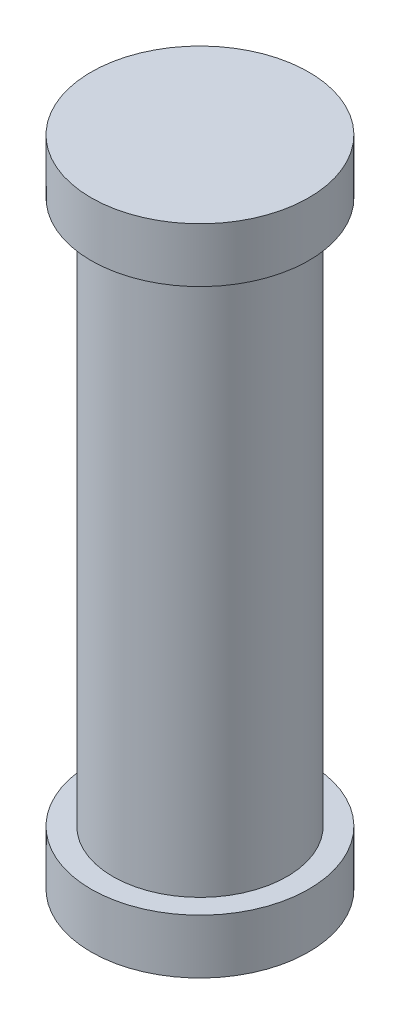
ISO-10303-21;
HEADER;
FILE_DESCRIPTION(('STEP AP214'),'2;1');
FILE_NAME('part.step','',(''),(''),'','','');
FILE_SCHEMA(('AUTOMOTIVE_DESIGN { 1 0 10303 214 1 1 1 1 }'));
ENDSEC;
DATA;
#1=APPLICATION_CONTEXT('core data for automotive mechanical design processes');
#2=APPLICATION_PROTOCOL_DEFINITION('international standard','automotive_design',2000,#1);
#3=PRODUCT_CONTEXT('',#1,'mechanical');
#4=PRODUCT('Part','Part','',(#3));
#5=PRODUCT_RELATED_PRODUCT_CATEGORY('part','',(#4));
#6=PRODUCT_DEFINITION_FORMATION('','',#4);
#7=PRODUCT_DEFINITION_CONTEXT('part definition',#1,'design');
#8=PRODUCT_DEFINITION('design','',#6,#7);
#9=PRODUCT_DEFINITION_SHAPE('','',#8);
#10=(LENGTH_UNIT() NAMED_UNIT(*) SI_UNIT(.MILLI.,.METRE.));
#11=(NAMED_UNIT(*) PLANE_ANGLE_UNIT() SI_UNIT($,.RADIAN.));
#12=(NAMED_UNIT(*) SI_UNIT($,.STERADIAN.) SOLID_ANGLE_UNIT());
#13=UNCERTAINTY_MEASURE_WITH_UNIT(LENGTH_MEASURE(1.E-05),#10,'distance_accuracy_value','');
#14=(GEOMETRIC_REPRESENTATION_CONTEXT(3) GLOBAL_UNCERTAINTY_ASSIGNED_CONTEXT((#13)) GLOBAL_UNIT_ASSIGNED_CONTEXT((#10,
#11,#12)) REPRESENTATION_CONTEXT('',''));
#15=CARTESIAN_POINT('',(0.,0.,0.));
#16=DIRECTION('',(0.,0.,1.));
#17=DIRECTION('',(1.,0.,0.));
#18=AXIS2_PLACEMENT_3D('',#15,#16,#17);
#19=CARTESIAN_POINT('',(0.,1.,0.));
#20=DIRECTION('',(0.,-1.,0.));
#21=DIRECTION('',(0.,0.,-1.));
#22=AXIS2_PLACEMENT_3D('',#19,#20,#21);
#23=CYLINDRICAL_SURFACE('',#22,2.);
#24=CARTESIAN_POINT('',(0.,1.,0.));
#25=DIRECTION('',(0.,1.,0.));
#26=DIRECTION('',(0.,0.,1.));
#27=AXIS2_PLACEMENT_3D('',#24,#25,#26);
#28=CIRCLE('',#27,2.);
#29=CARTESIAN_POINT('',(0.,1.,2.));
#30=VERTEX_POINT('',#29);
#31=EDGE_CURVE('E37',#30,#30,#28,.T.);
#32=ORIENTED_EDGE('',*,*,#31,.F.);
#33=EDGE_LOOP('',(#32));
#34=FACE_BOUND('',#33,.T.);
#35=CARTESIAN_POINT('',(0.,0.,0.));
#36=DIRECTION('',(0.,1.,0.));
#37=DIRECTION('',(0.,0.,1.));
#38=AXIS2_PLACEMENT_3D('',#35,#36,#37);
#39=CIRCLE('',#38,2.);
#40=CARTESIAN_POINT('',(0.,0.,2.));
#41=VERTEX_POINT('',#40);
#42=EDGE_CURVE('E33',#41,#41,#39,.T.);
#43=ORIENTED_EDGE('',*,*,#42,.T.);
#44=EDGE_LOOP('',(#43));
#45=FACE_BOUND('',#44,.T.);
#46=ADVANCED_FACE('F30',(#34,#45),#23,.T.);
#47=CARTESIAN_POINT('',(0.,1.,0.));
#48=DIRECTION('',(0.,1.,0.));
#49=DIRECTION('',(0.,0.,1.));
#50=AXIS2_PLACEMENT_3D('',#47,#48,#49);
#51=PLANE('',#50);
#52=CARTESIAN_POINT('',(0.,1.,0.));
#53=DIRECTION('',(0.,1.,0.));
#54=DIRECTION('',(0.,0.,1.));
#55=AXIS2_PLACEMENT_3D('',#52,#53,#54);
#56=CIRCLE('',#55,1.6);
#57=CARTESIAN_POINT('',(0.,1.,1.6));
#58=VERTEX_POINT('',#57);
#59=EDGE_CURVE('E10',#58,#58,#56,.T.);
#60=ORIENTED_EDGE('',*,*,#59,.F.);
#61=EDGE_LOOP('',(#60));
#62=FACE_BOUND('',#61,.T.);
#63=ORIENTED_EDGE('',*,*,#31,.T.);
#64=EDGE_LOOP('',(#63));
#65=FACE_BOUND('',#64,.T.);
#66=ADVANCED_FACE('F71',(#62,#65),#51,.T.);
#67=CARTESIAN_POINT('',(0.,0.,0.));
#68=DIRECTION('',(0.,1.,0.));
#69=DIRECTION('',(0.,0.,1.));
#70=AXIS2_PLACEMENT_3D('',#67,#68,#69);
#71=PLANE('',#70);
#72=ORIENTED_EDGE('',*,*,#42,.F.);
#73=EDGE_LOOP('',(#72));
#74=FACE_BOUND('',#73,.T.);
#75=ADVANCED_FACE('F76',(#74),#71,.F.);
#76=CARTESIAN_POINT('',(0.,11.,0.));
#77=DIRECTION('',(0.,-1.,0.));
#78=DIRECTION('',(0.,0.,-1.));
#79=AXIS2_PLACEMENT_3D('',#76,#77,#78);
#80=CYLINDRICAL_SURFACE('',#79,1.6);
#81=CARTESIAN_POINT('',(0.,11.,0.));
#82=DIRECTION('',(0.,1.,0.));
#83=DIRECTION('',(0.,0.,1.));
#84=AXIS2_PLACEMENT_3D('',#81,#82,#83);
#85=CIRCLE('',#84,1.6);
#86=CARTESIAN_POINT('',(0.,11.,1.6));
#87=VERTEX_POINT('',#86);
#88=EDGE_CURVE('E43',#87,#87,#85,.T.);
#89=ORIENTED_EDGE('',*,*,#88,.F.);
#90=EDGE_LOOP('',(#89));
#91=FACE_BOUND('',#90,.T.);
#92=ORIENTED_EDGE('',*,*,#59,.T.);
#93=EDGE_LOOP('',(#92));
#94=FACE_BOUND('',#93,.T.);
#95=ADVANCED_FACE('F58',(#91,#94),#80,.T.);
#96=CARTESIAN_POINT('',(0.,12.,0.));
#97=DIRECTION('',(0.,-1.,0.));
#98=DIRECTION('',(0.,0.,-1.));
#99=AXIS2_PLACEMENT_3D('',#96,#97,#98);
#100=CYLINDRICAL_SURFACE('',#99,2.);
#101=CARTESIAN_POINT('',(0.,12.,0.));
#102=DIRECTION('',(0.,1.,0.));
#103=DIRECTION('',(0.,0.,1.));
#104=AXIS2_PLACEMENT_3D('',#101,#102,#103);
#105=CIRCLE('',#104,2.);
#106=CARTESIAN_POINT('',(0.,12.,2.));
#107=VERTEX_POINT('',#106);
#108=EDGE_CURVE('E46',#107,#107,#105,.T.);
#109=ORIENTED_EDGE('',*,*,#108,.F.);
#110=EDGE_LOOP('',(#109));
#111=FACE_BOUND('',#110,.T.);
#112=CARTESIAN_POINT('',(0.,11.,0.));
#113=DIRECTION('',(0.,1.,0.));
#114=DIRECTION('',(0.,0.,1.));
#115=AXIS2_PLACEMENT_3D('',#112,#113,#114);
#116=CIRCLE('',#115,2.);
#117=CARTESIAN_POINT('',(0.,11.,2.));
#118=VERTEX_POINT('',#117);
#119=EDGE_CURVE('E47',#118,#118,#116,.T.);
#120=ORIENTED_EDGE('',*,*,#119,.T.);
#121=EDGE_LOOP('',(#120));
#122=FACE_BOUND('',#121,.T.);
#123=ADVANCED_FACE('F55',(#111,#122),#100,.T.);
#124=CARTESIAN_POINT('',(0.,12.,0.));
#125=DIRECTION('',(0.,1.,0.));
#126=DIRECTION('',(0.,0.,1.));
#127=AXIS2_PLACEMENT_3D('',#124,#125,#126);
#128=PLANE('',#127);
#129=ORIENTED_EDGE('',*,*,#108,.T.);
#130=EDGE_LOOP('',(#129));
#131=FACE_BOUND('',#130,.T.);
#132=ADVANCED_FACE('F53',(#131),#128,.T.);
#133=CARTESIAN_POINT('',(0.,11.,0.));
#134=DIRECTION('',(0.,1.,0.));
#135=DIRECTION('',(0.,0.,1.));
#136=AXIS2_PLACEMENT_3D('',#133,#134,#135);
#137=PLANE('',#136);
#138=ORIENTED_EDGE('',*,*,#88,.T.);
#139=EDGE_LOOP('',(#138));
#140=FACE_BOUND('',#139,.T.);
#141=ORIENTED_EDGE('',*,*,#119,.F.);
#142=EDGE_LOOP('',(#141));
#143=FACE_BOUND('',#142,.T.);
#144=ADVANCED_FACE('F62',(#140,#143),#137,.F.);
#145=CLOSED_SHELL('',(#46,#66,#75,#95,#123,#132,#144));
#146=MANIFOLD_SOLID_BREP('B2',#145);
#147=ADVANCED_BREP_SHAPE_REPRESENTATION('',(#18,#146),#14);
#148=SHAPE_DEFINITION_REPRESENTATION(#9,#147);
ENDSEC;
END-ISO-10303-21;
